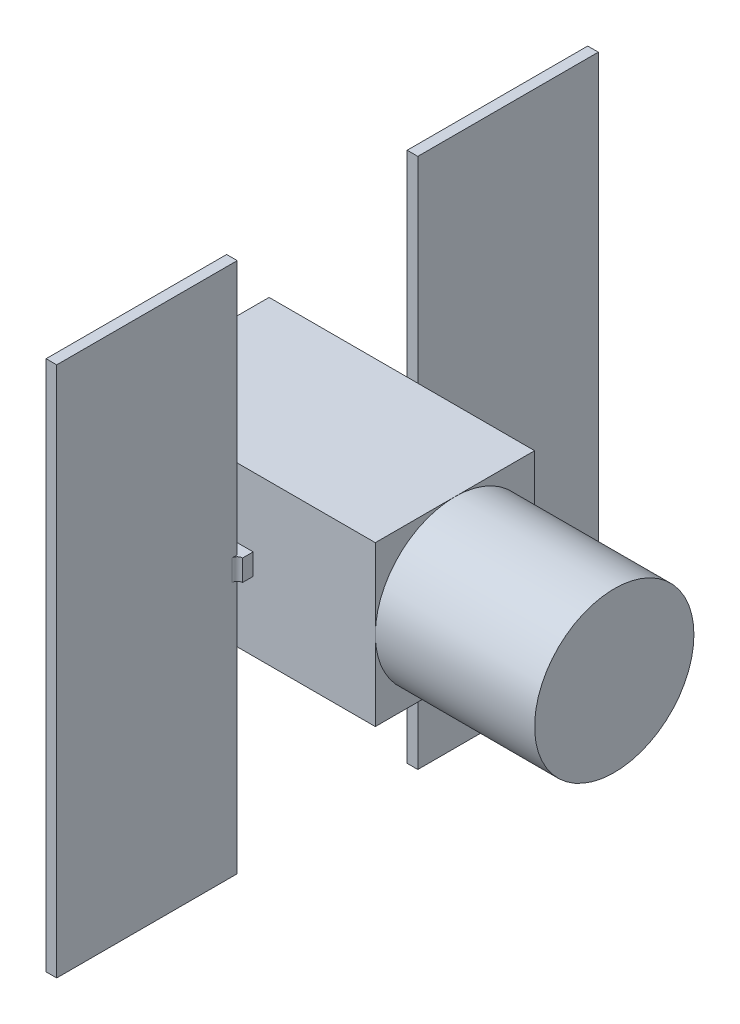
ISO-10303-21;
HEADER;
FILE_DESCRIPTION(('STEP AP214'),'2;1');
FILE_NAME('part.step','',(''),(''),'','','');
FILE_SCHEMA(('AUTOMOTIVE_DESIGN { 1 0 10303 214 1 1 1 1 }'));
ENDSEC;
DATA;
#1=APPLICATION_CONTEXT('core data for automotive mechanical design processes');
#2=APPLICATION_PROTOCOL_DEFINITION('international standard','automotive_design',2000,#1);
#3=PRODUCT_CONTEXT('',#1,'mechanical');
#4=PRODUCT('Part','Part','',(#3));
#5=PRODUCT_RELATED_PRODUCT_CATEGORY('part','',(#4));
#6=PRODUCT_DEFINITION_FORMATION('','',#4);
#7=PRODUCT_DEFINITION_CONTEXT('part definition',#1,'design');
#8=PRODUCT_DEFINITION('design','',#6,#7);
#9=PRODUCT_DEFINITION_SHAPE('','',#8);
#10=(LENGTH_UNIT() NAMED_UNIT(*) SI_UNIT(.MILLI.,.METRE.));
#11=(NAMED_UNIT(*) PLANE_ANGLE_UNIT() SI_UNIT($,.RADIAN.));
#12=(NAMED_UNIT(*) SI_UNIT($,.STERADIAN.) SOLID_ANGLE_UNIT());
#13=UNCERTAINTY_MEASURE_WITH_UNIT(LENGTH_MEASURE(1.E-05),#10,'distance_accuracy_value','');
#14=(GEOMETRIC_REPRESENTATION_CONTEXT(3) GLOBAL_UNCERTAINTY_ASSIGNED_CONTEXT((#13)) GLOBAL_UNIT_ASSIGNED_CONTEXT((#10,
#11,#12)) REPRESENTATION_CONTEXT('',''));
#15=CARTESIAN_POINT('',(0.,0.,0.));
#16=DIRECTION('',(0.,0.,1.));
#17=DIRECTION('',(1.,0.,0.));
#18=AXIS2_PLACEMENT_3D('',#15,#16,#17);
#19=CARTESIAN_POINT('',(250.,-150.,-150.));
#20=DIRECTION('',(1.,0.,0.));
#21=DIRECTION('',(0.,0.,-1.));
#22=AXIS2_PLACEMENT_3D('',#19,#20,#21);
#23=PLANE('',#22);
#24=CARTESIAN_POINT('',(250.,0.,0.));
#25=DIRECTION('',(1.,0.,0.));
#26=DIRECTION('',(0.,0.,-1.));
#27=AXIS2_PLACEMENT_3D('',#24,#25,#26);
#28=CIRCLE('',#27,150.);
#29=CARTESIAN_POINT('',(250.,0.,-150.));
#30=VERTEX_POINT('',#29);
#31=CARTESIAN_POINT('',(250.,150.,0.));
#32=VERTEX_POINT('',#31);
#33=EDGE_CURVE('E46',#30,#32,#28,.T.);
#34=ORIENTED_EDGE('',*,*,#33,.F.);
#35=DIRECTION('',(0.,1.,0.));
#36=VECTOR('',#35,1.);
#37=CARTESIAN_POINT('',(250.,-150.,-150.));
#38=LINE('',#37,#36);
#39=CARTESIAN_POINT('',(250.,150.,-150.));
#40=VERTEX_POINT('',#39);
#41=EDGE_CURVE('E242',#30,#40,#38,.T.);
#42=ORIENTED_EDGE('',*,*,#41,.T.);
#43=DIRECTION('',(0.,0.,1.));
#44=VECTOR('',#43,1.);
#45=CARTESIAN_POINT('',(250.,150.,-150.));
#46=LINE('',#45,#44);
#47=EDGE_CURVE('E254',#40,#32,#46,.T.);
#48=ORIENTED_EDGE('',*,*,#47,.T.);
#49=EDGE_LOOP('',(#34,#42,#48));
#50=FACE_BOUND('',#49,.T.);
#51=ADVANCED_FACE('F35',(#50),#23,.T.);
#52=CARTESIAN_POINT('',(250.,0.,150.));
#53=VERTEX_POINT('',#52);
#54=EDGE_CURVE('E11',#32,#53,#28,.T.);
#55=ORIENTED_EDGE('',*,*,#54,.F.);
#56=CARTESIAN_POINT('',(250.,150.,150.));
#57=VERTEX_POINT('',#56);
#58=EDGE_CURVE('E440',#32,#57,#46,.T.);
#59=ORIENTED_EDGE('',*,*,#58,.T.);
#60=DIRECTION('',(0.,1.,0.));
#61=VECTOR('',#60,1.);
#62=CARTESIAN_POINT('',(250.,-150.,150.));
#63=LINE('',#62,#61);
#64=EDGE_CURVE('E422',#53,#57,#63,.T.);
#65=ORIENTED_EDGE('',*,*,#64,.F.);
#66=EDGE_LOOP('',(#55,#59,#65));
#67=FACE_BOUND('',#66,.T.);
#68=ADVANCED_FACE('F553',(#67),#23,.T.);
#69=CARTESIAN_POINT('',(250.,-150.,0.));
#70=VERTEX_POINT('',#69);
#71=EDGE_CURVE('E44',#53,#70,#28,.T.);
#72=ORIENTED_EDGE('',*,*,#71,.F.);
#73=CARTESIAN_POINT('',(250.,-150.,150.));
#74=VERTEX_POINT('',#73);
#75=EDGE_CURVE('E423',#74,#53,#63,.T.);
#76=ORIENTED_EDGE('',*,*,#75,.F.);
#77=DIRECTION('',(0.,0.,1.));
#78=VECTOR('',#77,1.);
#79=CARTESIAN_POINT('',(250.,-150.,-150.));
#80=LINE('',#79,#78);
#81=EDGE_CURVE('E443',#70,#74,#80,.T.);
#82=ORIENTED_EDGE('',*,*,#81,.F.);
#83=EDGE_LOOP('',(#72,#76,#82));
#84=FACE_BOUND('',#83,.T.);
#85=ADVANCED_FACE('F558',(#84),#23,.T.);
#86=CARTESIAN_POINT('',(0.,0.,150.));
#87=DIRECTION('',(0.,0.,-1.));
#88=DIRECTION('',(-1.,0.,0.));
#89=AXIS2_PLACEMENT_3D('',#86,#87,#88);
#90=PLANE('',#89);
#91=ORIENTED_EDGE('',*,*,#75,.T.);
#92=ORIENTED_EDGE('',*,*,#64,.T.);
#93=DIRECTION('',(-1.,0.,0.));
#94=VECTOR('',#93,1.);
#95=CARTESIAN_POINT('',(-250.,150.,150.));
#96=LINE('',#95,#94);
#97=CARTESIAN_POINT('',(-250.,150.,150.));
#98=VERTEX_POINT('',#97);
#99=EDGE_CURVE('E426',#57,#98,#96,.T.);
#100=ORIENTED_EDGE('',*,*,#99,.T.);
#101=DIRECTION('',(0.,-1.,0.));
#102=VECTOR('',#101,1.);
#103=CARTESIAN_POINT('',(-250.,-150.,150.));
#104=LINE('',#103,#102);
#105=CARTESIAN_POINT('',(-250.,-150.,150.));
#106=VERTEX_POINT('',#105);
#107=EDGE_CURVE('E429',#98,#106,#104,.T.);
#108=ORIENTED_EDGE('',*,*,#107,.T.);
#109=DIRECTION('',(1.,0.,0.));
#110=VECTOR('',#109,1.);
#111=CARTESIAN_POINT('',(-250.,-150.,150.));
#112=LINE('',#111,#110);
#113=EDGE_CURVE('E252',#106,#74,#112,.T.);
#114=ORIENTED_EDGE('',*,*,#113,.T.);
#115=EDGE_LOOP('',(#91,#92,#100,#108,#114));
#116=FACE_BOUND('',#115,.T.);
#117=DIRECTION('',(0.,1.,0.));
#118=VECTOR('',#117,1.);
#119=CARTESIAN_POINT('',(20.,-20.,150.));
#120=LINE('',#119,#118);
#121=CARTESIAN_POINT('',(20.,-20.,150.));
#122=VERTEX_POINT('',#121);
#123=CARTESIAN_POINT('',(20.,20.,150.));
#124=VERTEX_POINT('',#123);
#125=EDGE_CURVE('E386',#122,#124,#120,.T.);
#126=ORIENTED_EDGE('',*,*,#125,.F.);
#127=DIRECTION('',(1.,0.,0.));
#128=VECTOR('',#127,1.);
#129=CARTESIAN_POINT('',(-20.,-20.,150.));
#130=LINE('',#129,#128);
#131=CARTESIAN_POINT('',(-20.,-20.,150.));
#132=VERTEX_POINT('',#131);
#133=EDGE_CURVE('E391',#132,#122,#130,.T.);
#134=ORIENTED_EDGE('',*,*,#133,.F.);
#135=DIRECTION('',(0.,-1.,0.));
#136=VECTOR('',#135,1.);
#137=CARTESIAN_POINT('',(-20.,-20.,150.));
#138=LINE('',#137,#136);
#139=CARTESIAN_POINT('',(-20.,20.,150.));
#140=VERTEX_POINT('',#139);
#141=EDGE_CURVE('E406',#140,#132,#138,.T.);
#142=ORIENTED_EDGE('',*,*,#141,.F.);
#143=DIRECTION('',(-1.,0.,0.));
#144=VECTOR('',#143,1.);
#145=CARTESIAN_POINT('',(-20.,20.,150.));
#146=LINE('',#145,#144);
#147=EDGE_CURVE('E403',#124,#140,#146,.T.);
#148=ORIENTED_EDGE('',*,*,#147,.F.);
#149=EDGE_LOOP('',(#126,#134,#142,#148));
#150=FACE_BOUND('',#149,.T.);
#151=ADVANCED_FACE('F564',(#116,#150),#90,.F.);
#152=EDGE_CURVE('E53',#70,#30,#28,.T.);
#153=ORIENTED_EDGE('',*,*,#152,.F.);
#154=CARTESIAN_POINT('',(250.,-150.,-150.));
#155=VERTEX_POINT('',#154);
#156=EDGE_CURVE('E237',#155,#70,#80,.T.);
#157=ORIENTED_EDGE('',*,*,#156,.F.);
#158=EDGE_CURVE('E233',#155,#30,#38,.T.);
#159=ORIENTED_EDGE('',*,*,#158,.T.);
#160=EDGE_LOOP('',(#153,#157,#159));
#161=FACE_BOUND('',#160,.T.);
#162=ADVANCED_FACE('F235',(#161),#23,.T.);
#163=CARTESIAN_POINT('',(-250.,-150.,-150.));
#164=DIRECTION('',(0.,-1.,0.));
#165=DIRECTION('',(0.,0.,-1.));
#166=AXIS2_PLACEMENT_3D('',#163,#164,#165);
#167=PLANE('',#166);
#168=ORIENTED_EDGE('',*,*,#156,.T.);
#169=ORIENTED_EDGE('',*,*,#81,.T.);
#170=ORIENTED_EDGE('',*,*,#113,.F.);
#171=DIRECTION('',(0.,0.,1.));
#172=VECTOR('',#171,1.);
#173=CARTESIAN_POINT('',(-250.,-150.,-150.));
#174=LINE('',#173,#172);
#175=CARTESIAN_POINT('',(-250.,-150.,-150.));
#176=VERTEX_POINT('',#175);
#177=EDGE_CURVE('E444',#176,#106,#174,.T.);
#178=ORIENTED_EDGE('',*,*,#177,.F.);
#179=DIRECTION('',(1.,0.,0.));
#180=VECTOR('',#179,1.);
#181=CARTESIAN_POINT('',(-250.,-150.,-150.));
#182=LINE('',#181,#180);
#183=EDGE_CURVE('E438',#176,#155,#182,.T.);
#184=ORIENTED_EDGE('',*,*,#183,.T.);
#185=EDGE_LOOP('',(#168,#169,#170,#178,#184));
#186=FACE_BOUND('',#185,.T.);
#187=ADVANCED_FACE('F563',(#186),#167,.T.);
#188=CARTESIAN_POINT('',(-250.,-150.,-150.));
#189=DIRECTION('',(-1.,0.,0.));
#190=DIRECTION('',(0.,0.,1.));
#191=AXIS2_PLACEMENT_3D('',#188,#189,#190);
#192=PLANE('',#191);
#193=CARTESIAN_POINT('',(-250.,0.,-58.043987529428));
#194=DIRECTION('',(-1.,0.,0.));
#195=DIRECTION('',(0.,0.,1.));
#196=AXIS2_PLACEMENT_3D('',#193,#194,#195);
#197=CIRCLE('',#196,40.);
#198=CARTESIAN_POINT('',(-250.,0.,-18.043987529428));
#199=VERTEX_POINT('',#198);
#200=EDGE_CURVE('E39',#199,#199,#197,.T.);
#201=ORIENTED_EDGE('',*,*,#200,.F.);
#202=EDGE_LOOP('',(#201));
#203=FACE_BOUND('',#202,.T.);
#204=CARTESIAN_POINT('',(-250.,0.,58.043987529428));
#205=DIRECTION('',(-1.,0.,0.));
#206=DIRECTION('',(0.,0.,1.));
#207=AXIS2_PLACEMENT_3D('',#204,#205,#206);
#208=CIRCLE('',#207,40.);
#209=CARTESIAN_POINT('',(-250.,0.,98.043987529428));
#210=VERTEX_POINT('',#209);
#211=EDGE_CURVE('E342',#210,#210,#208,.T.);
#212=ORIENTED_EDGE('',*,*,#211,.F.);
#213=EDGE_LOOP('',(#212));
#214=FACE_BOUND('',#213,.T.);
#215=ORIENTED_EDGE('',*,*,#177,.T.);
#216=ORIENTED_EDGE('',*,*,#107,.F.);
#217=DIRECTION('',(0.,0.,1.));
#218=VECTOR('',#217,1.);
#219=CARTESIAN_POINT('',(-250.,150.,-150.));
#220=LINE('',#219,#218);
#221=CARTESIAN_POINT('',(-250.,150.,-150.));
#222=VERTEX_POINT('',#221);
#223=EDGE_CURVE('E446',#222,#98,#220,.T.);
#224=ORIENTED_EDGE('',*,*,#223,.F.);
#225=DIRECTION('',(0.,-1.,0.));
#226=VECTOR('',#225,1.);
#227=CARTESIAN_POINT('',(-250.,-150.,-150.));
#228=LINE('',#227,#226);
#229=EDGE_CURVE('E435',#222,#176,#228,.T.);
#230=ORIENTED_EDGE('',*,*,#229,.T.);
#231=EDGE_LOOP('',(#215,#216,#224,#230));
#232=FACE_BOUND('',#231,.T.);
#233=ADVANCED_FACE('F569',(#203,#214,#232),#192,.T.);
#234=CARTESIAN_POINT('',(-250.,150.,-150.));
#235=DIRECTION('',(0.,1.,0.));
#236=DIRECTION('',(0.,0.,1.));
#237=AXIS2_PLACEMENT_3D('',#234,#235,#236);
#238=PLANE('',#237);
#239=ORIENTED_EDGE('',*,*,#223,.T.);
#240=ORIENTED_EDGE('',*,*,#99,.F.);
#241=ORIENTED_EDGE('',*,*,#58,.F.);
#242=ORIENTED_EDGE('',*,*,#47,.F.);
#243=DIRECTION('',(-1.,0.,0.));
#244=VECTOR('',#243,1.);
#245=CARTESIAN_POINT('',(-250.,150.,-150.));
#246=LINE('',#245,#244);
#247=EDGE_CURVE('E241',#40,#222,#246,.T.);
#248=ORIENTED_EDGE('',*,*,#247,.T.);
#249=EDGE_LOOP('',(#239,#240,#241,#242,#248));
#250=FACE_BOUND('',#249,.T.);
#251=ADVANCED_FACE('F602',(#250),#238,.T.);
#252=CARTESIAN_POINT('',(0.,0.,-150.));
#253=DIRECTION('',(0.,0.,-1.));
#254=DIRECTION('',(-1.,0.,0.));
#255=AXIS2_PLACEMENT_3D('',#252,#253,#254);
#256=PLANE('',#255);
#257=DIRECTION('',(0.,1.,0.));
#258=VECTOR('',#257,1.);
#259=CARTESIAN_POINT('',(20.,-20.,-150.));
#260=LINE('',#259,#258);
#261=CARTESIAN_POINT('',(20.,-20.,-150.));
#262=VERTEX_POINT('',#261);
#263=CARTESIAN_POINT('',(20.,20.,-150.));
#264=VERTEX_POINT('',#263);
#265=EDGE_CURVE('E307',#262,#264,#260,.T.);
#266=ORIENTED_EDGE('',*,*,#265,.T.);
#267=DIRECTION('',(-1.,0.,0.));
#268=VECTOR('',#267,1.);
#269=CARTESIAN_POINT('',(-20.,20.,-150.));
#270=LINE('',#269,#268);
#271=CARTESIAN_POINT('',(-20.,20.,-150.));
#272=VERTEX_POINT('',#271);
#273=EDGE_CURVE('E312',#264,#272,#270,.T.);
#274=ORIENTED_EDGE('',*,*,#273,.T.);
#275=DIRECTION('',(0.,-1.,0.));
#276=VECTOR('',#275,1.);
#277=CARTESIAN_POINT('',(-20.,-20.,-150.));
#278=LINE('',#277,#276);
#279=CARTESIAN_POINT('',(-20.,-20.,-150.));
#280=VERTEX_POINT('',#279);
#281=EDGE_CURVE('E325',#272,#280,#278,.T.);
#282=ORIENTED_EDGE('',*,*,#281,.T.);
#283=DIRECTION('',(1.,0.,0.));
#284=VECTOR('',#283,1.);
#285=CARTESIAN_POINT('',(-20.,-20.,-150.));
#286=LINE('',#285,#284);
#287=EDGE_CURVE('E323',#280,#262,#286,.T.);
#288=ORIENTED_EDGE('',*,*,#287,.T.);
#289=EDGE_LOOP('',(#266,#274,#282,#288));
#290=FACE_BOUND('',#289,.T.);
#291=ORIENTED_EDGE('',*,*,#158,.F.);
#292=ORIENTED_EDGE('',*,*,#183,.F.);
#293=ORIENTED_EDGE('',*,*,#229,.F.);
#294=ORIENTED_EDGE('',*,*,#247,.F.);
#295=ORIENTED_EDGE('',*,*,#41,.F.);
#296=EDGE_LOOP('',(#291,#292,#293,#294,#295));
#297=FACE_BOUND('',#296,.T.);
#298=ADVANCED_FACE('F246',(#290,#297),#256,.T.);
#299=CARTESIAN_POINT('',(20.,-20.,170.));
#300=DIRECTION('',(-1.,0.,0.));
#301=DIRECTION('',(0.,0.,1.));
#302=AXIS2_PLACEMENT_3D('',#299,#300,#301);
#303=PLANE('',#302);
#304=ORIENTED_EDGE('',*,*,#125,.T.);
#305=DIRECTION('',(0.,0.,-1.));
#306=VECTOR('',#305,1.);
#307=CARTESIAN_POINT('',(20.,20.,170.));
#308=LINE('',#307,#306);
#309=CARTESIAN_POINT('',(20.,20.,170.));
#310=VERTEX_POINT('',#309);
#311=EDGE_CURVE('E419',#310,#124,#308,.T.);
#312=ORIENTED_EDGE('',*,*,#311,.F.);
#313=DIRECTION('',(0.,1.,0.));
#314=VECTOR('',#313,1.);
#315=CARTESIAN_POINT('',(20.,-20.,170.));
#316=LINE('',#315,#314);
#317=CARTESIAN_POINT('',(20.,-20.,170.));
#318=VERTEX_POINT('',#317);
#319=EDGE_CURVE('E387',#318,#310,#316,.T.);
#320=ORIENTED_EDGE('',*,*,#319,.F.);
#321=DIRECTION('',(0.,0.,-1.));
#322=VECTOR('',#321,1.);
#323=CARTESIAN_POINT('',(20.,-20.,170.));
#324=LINE('',#323,#322);
#325=EDGE_CURVE('E400',#318,#122,#324,.T.);
#326=ORIENTED_EDGE('',*,*,#325,.T.);
#327=EDGE_LOOP('',(#304,#312,#320,#326));
#328=FACE_BOUND('',#327,.T.);
#329=ADVANCED_FACE('F614',(#328),#303,.F.);
#330=CARTESIAN_POINT('',(-20.,20.,170.));
#331=DIRECTION('',(0.,-1.,0.));
#332=DIRECTION('',(0.,0.,-1.));
#333=AXIS2_PLACEMENT_3D('',#330,#331,#332);
#334=PLANE('',#333);
#335=ORIENTED_EDGE('',*,*,#147,.T.);
#336=DIRECTION('',(0.,0.,-1.));
#337=VECTOR('',#336,1.);
#338=CARTESIAN_POINT('',(-20.,20.,170.));
#339=LINE('',#338,#337);
#340=CARTESIAN_POINT('',(-20.,20.,170.));
#341=VERTEX_POINT('',#340);
#342=EDGE_CURVE('E416',#341,#140,#339,.T.);
#343=ORIENTED_EDGE('',*,*,#342,.F.);
#344=CARTESIAN_POINT('',(-20.,20.,180.));
#345=DIRECTION('',(0.,-1.,0.));
#346=DIRECTION('',(0.,0.,-1.));
#347=AXIS2_PLACEMENT_3D('',#344,#345,#346);
#348=CIRCLE('',#347,10.);
#349=CARTESIAN_POINT('',(-10.,20.,180.));
#350=VERTEX_POINT('',#349);
#351=EDGE_CURVE('E347',#341,#350,#348,.T.);
#352=ORIENTED_EDGE('',*,*,#351,.T.);
#353=DIRECTION('',(0.,0.,1.));
#354=VECTOR('',#353,1.);
#355=CARTESIAN_POINT('',(-10.,20.,170.));
#356=LINE('',#355,#354);
#357=CARTESIAN_POINT('',(-10.,20.,170.));
#358=VERTEX_POINT('',#357);
#359=EDGE_CURVE('E456',#358,#350,#356,.T.);
#360=ORIENTED_EDGE('',*,*,#359,.F.);
#361=DIRECTION('',(-1.,0.,0.));
#362=VECTOR('',#361,1.);
#363=CARTESIAN_POINT('',(-20.,20.,170.));
#364=LINE('',#363,#362);
#365=CARTESIAN_POINT('',(10.,20.,170.));
#366=VERTEX_POINT('',#365);
#367=EDGE_CURVE('E390',#366,#358,#364,.T.);
#368=ORIENTED_EDGE('',*,*,#367,.F.);
#369=DIRECTION('',(0.,0.,-1.));
#370=VECTOR('',#369,1.);
#371=CARTESIAN_POINT('',(10.,20.,170.));
#372=LINE('',#371,#370);
#373=CARTESIAN_POINT('',(10.,20.,180.));
#374=VERTEX_POINT('',#373);
#375=EDGE_CURVE('E454',#374,#366,#372,.T.);
#376=ORIENTED_EDGE('',*,*,#375,.F.);
#377=CARTESIAN_POINT('',(20.,20.,180.));
#378=DIRECTION('',(0.,-1.,0.));
#379=DIRECTION('',(0.,0.,-1.));
#380=AXIS2_PLACEMENT_3D('',#377,#378,#379);
#381=CIRCLE('',#380,10.);
#382=EDGE_CURVE('E464',#374,#310,#381,.T.);
#383=ORIENTED_EDGE('',*,*,#382,.T.);
#384=ORIENTED_EDGE('',*,*,#311,.T.);
#385=EDGE_LOOP('',(#335,#343,#352,#360,#368,#376,#383,#384));
#386=FACE_BOUND('',#385,.T.);
#387=ADVANCED_FACE('F826',(#386),#334,.F.);
#388=CARTESIAN_POINT('',(-20.,-20.,170.));
#389=DIRECTION('',(1.,0.,0.));
#390=DIRECTION('',(0.,0.,-1.));
#391=AXIS2_PLACEMENT_3D('',#388,#389,#390);
#392=PLANE('',#391);
#393=ORIENTED_EDGE('',*,*,#141,.T.);
#394=DIRECTION('',(0.,0.,-1.));
#395=VECTOR('',#394,1.);
#396=CARTESIAN_POINT('',(-20.,-20.,170.));
#397=LINE('',#396,#395);
#398=CARTESIAN_POINT('',(-20.,-20.,170.));
#399=VERTEX_POINT('',#398);
#400=EDGE_CURVE('E413',#399,#132,#397,.T.);
#401=ORIENTED_EDGE('',*,*,#400,.F.);
#402=DIRECTION('',(0.,-1.,0.));
#403=VECTOR('',#402,1.);
#404=CARTESIAN_POINT('',(-20.,-20.,170.));
#405=LINE('',#404,#403);
#406=EDGE_CURVE('E394',#341,#399,#405,.T.);
#407=ORIENTED_EDGE('',*,*,#406,.F.);
#408=ORIENTED_EDGE('',*,*,#342,.T.);
#409=EDGE_LOOP('',(#393,#401,#407,#408));
#410=FACE_BOUND('',#409,.T.);
#411=ADVANCED_FACE('F836',(#410),#392,.F.);
#412=CARTESIAN_POINT('',(-20.,-20.,170.));
#413=DIRECTION('',(0.,1.,0.));
#414=DIRECTION('',(0.,0.,1.));
#415=AXIS2_PLACEMENT_3D('',#412,#413,#414);
#416=PLANE('',#415);
#417=ORIENTED_EDGE('',*,*,#133,.T.);
#418=ORIENTED_EDGE('',*,*,#325,.F.);
#419=CARTESIAN_POINT('',(20.,-20.,180.));
#420=DIRECTION('',(0.,1.,0.));
#421=DIRECTION('',(0.,0.,1.));
#422=AXIS2_PLACEMENT_3D('',#419,#420,#421);
#423=CIRCLE('',#422,10.);
#424=CARTESIAN_POINT('',(10.,-20.,180.));
#425=VERTEX_POINT('',#424);
#426=EDGE_CURVE('E466',#318,#425,#423,.T.);
#427=ORIENTED_EDGE('',*,*,#426,.T.);
#428=DIRECTION('',(0.,0.,1.));
#429=VECTOR('',#428,1.);
#430=CARTESIAN_POINT('',(10.,-20.,170.));
#431=LINE('',#430,#429);
#432=CARTESIAN_POINT('',(10.,-20.,170.));
#433=VERTEX_POINT('',#432);
#434=EDGE_CURVE('E442',#433,#425,#431,.T.);
#435=ORIENTED_EDGE('',*,*,#434,.F.);
#436=DIRECTION('',(1.,0.,0.));
#437=VECTOR('',#436,1.);
#438=CARTESIAN_POINT('',(-20.,-20.,170.));
#439=LINE('',#438,#437);
#440=CARTESIAN_POINT('',(-10.,-20.,170.));
#441=VERTEX_POINT('',#440);
#442=EDGE_CURVE('E397',#441,#433,#439,.T.);
#443=ORIENTED_EDGE('',*,*,#442,.F.);
#444=DIRECTION('',(0.,0.,-1.));
#445=VECTOR('',#444,1.);
#446=CARTESIAN_POINT('',(-10.,-20.,170.));
#447=LINE('',#446,#445);
#448=CARTESIAN_POINT('',(-10.,-20.,180.));
#449=VERTEX_POINT('',#448);
#450=EDGE_CURVE('E462',#449,#441,#447,.T.);
#451=ORIENTED_EDGE('',*,*,#450,.F.);
#452=CARTESIAN_POINT('',(-20.,-20.,180.));
#453=DIRECTION('',(0.,1.,0.));
#454=DIRECTION('',(0.,0.,1.));
#455=AXIS2_PLACEMENT_3D('',#452,#453,#454);
#456=CIRCLE('',#455,10.);
#457=EDGE_CURVE('E468',#449,#399,#456,.T.);
#458=ORIENTED_EDGE('',*,*,#457,.T.);
#459=ORIENTED_EDGE('',*,*,#400,.T.);
#460=EDGE_LOOP('',(#417,#418,#427,#435,#443,#451,#458,#459));
#461=FACE_BOUND('',#460,.T.);
#462=ADVANCED_FACE('F845',(#461),#416,.F.);
#463=CARTESIAN_POINT('',(0.,0.,170.));
#464=DIRECTION('',(0.,0.,-1.));
#465=DIRECTION('',(-1.,0.,0.));
#466=AXIS2_PLACEMENT_3D('',#463,#464,#465);
#467=PLANE('',#466);
#468=DIRECTION('',(0.,1.,0.));
#469=VECTOR('',#468,1.);
#470=CARTESIAN_POINT('',(10.,-500.,170.));
#471=LINE('',#470,#469);
#472=CARTESIAN_POINT('',(10.,500.,170.));
#473=VERTEX_POINT('',#472);
#474=EDGE_CURVE('E351',#366,#473,#471,.T.);
#475=ORIENTED_EDGE('',*,*,#474,.F.);
#476=ORIENTED_EDGE('',*,*,#367,.T.);
#477=DIRECTION('',(0.,-1.,0.));
#478=VECTOR('',#477,1.);
#479=CARTESIAN_POINT('',(-10.,-500.,170.));
#480=LINE('',#479,#478);
#481=CARTESIAN_POINT('',(-10.,500.,170.));
#482=VERTEX_POINT('',#481);
#483=EDGE_CURVE('E371',#482,#358,#480,.T.);
#484=ORIENTED_EDGE('',*,*,#483,.F.);
#485=DIRECTION('',(-1.,0.,0.));
#486=VECTOR('',#485,1.);
#487=CARTESIAN_POINT('',(-10.,500.,170.));
#488=LINE('',#487,#486);
#489=EDGE_CURVE('E368',#473,#482,#488,.T.);
#490=ORIENTED_EDGE('',*,*,#489,.F.);
#491=EDGE_LOOP('',(#475,#476,#484,#490));
#492=FACE_BOUND('',#491,.T.);
#493=ADVANCED_FACE('F771',(#492),#467,.T.);
#494=CARTESIAN_POINT('',(10.,-500.,510.));
#495=DIRECTION('',(-1.,0.,0.));
#496=DIRECTION('',(0.,0.,1.));
#497=AXIS2_PLACEMENT_3D('',#494,#495,#496);
#498=PLANE('',#497);
#499=DIRECTION('',(0.,1.,0.));
#500=VECTOR('',#499,1.);
#501=CARTESIAN_POINT('',(10.,20.,180.));
#502=LINE('',#501,#500);
#503=EDGE_CURVE('E451',#425,#374,#502,.T.);
#504=ORIENTED_EDGE('',*,*,#503,.T.);
#505=ORIENTED_EDGE('',*,*,#375,.T.);
#506=ORIENTED_EDGE('',*,*,#474,.T.);
#507=DIRECTION('',(0.,0.,-1.));
#508=VECTOR('',#507,1.);
#509=CARTESIAN_POINT('',(10.,500.,510.));
#510=LINE('',#509,#508);
#511=CARTESIAN_POINT('',(10.,500.,510.));
#512=VERTEX_POINT('',#511);
#513=EDGE_CURVE('E383',#512,#473,#510,.T.);
#514=ORIENTED_EDGE('',*,*,#513,.F.);
#515=DIRECTION('',(0.,1.,0.));
#516=VECTOR('',#515,1.);
#517=CARTESIAN_POINT('',(10.,-500.,510.));
#518=LINE('',#517,#516);
#519=CARTESIAN_POINT('',(10.,-500.,510.));
#520=VERTEX_POINT('',#519);
#521=EDGE_CURVE('E354',#520,#512,#518,.T.);
#522=ORIENTED_EDGE('',*,*,#521,.F.);
#523=DIRECTION('',(0.,0.,-1.));
#524=VECTOR('',#523,1.);
#525=CARTESIAN_POINT('',(10.,-500.,510.));
#526=LINE('',#525,#524);
#527=CARTESIAN_POINT('',(10.,-500.,170.));
#528=VERTEX_POINT('',#527);
#529=EDGE_CURVE('E364',#520,#528,#526,.T.);
#530=ORIENTED_EDGE('',*,*,#529,.T.);
#531=EDGE_CURVE('E365',#528,#433,#471,.T.);
#532=ORIENTED_EDGE('',*,*,#531,.T.);
#533=ORIENTED_EDGE('',*,*,#434,.T.);
#534=EDGE_LOOP('',(#504,#505,#506,#514,#522,#530,#532,#533));
#535=FACE_BOUND('',#534,.T.);
#536=ADVANCED_FACE('F768',(#535),#498,.F.);
#537=CARTESIAN_POINT('',(-10.,500.,510.));
#538=DIRECTION('',(0.,-1.,0.));
#539=DIRECTION('',(0.,0.,-1.));
#540=AXIS2_PLACEMENT_3D('',#537,#538,#539);
#541=PLANE('',#540);
#542=ORIENTED_EDGE('',*,*,#489,.T.);
#543=DIRECTION('',(0.,0.,-1.));
#544=VECTOR('',#543,1.);
#545=CARTESIAN_POINT('',(-10.,500.,510.));
#546=LINE('',#545,#544);
#547=CARTESIAN_POINT('',(-10.,500.,510.));
#548=VERTEX_POINT('',#547);
#549=EDGE_CURVE('E380',#548,#482,#546,.T.);
#550=ORIENTED_EDGE('',*,*,#549,.F.);
#551=DIRECTION('',(-1.,0.,0.));
#552=VECTOR('',#551,1.);
#553=CARTESIAN_POINT('',(-10.,500.,510.));
#554=LINE('',#553,#552);
#555=EDGE_CURVE('E357',#512,#548,#554,.T.);
#556=ORIENTED_EDGE('',*,*,#555,.F.);
#557=ORIENTED_EDGE('',*,*,#513,.T.);
#558=EDGE_LOOP('',(#542,#550,#556,#557));
#559=FACE_BOUND('',#558,.T.);
#560=ADVANCED_FACE('F758',(#559),#541,.F.);
#561=CARTESIAN_POINT('',(-10.,-500.,510.));
#562=DIRECTION('',(1.,0.,0.));
#563=DIRECTION('',(0.,0.,-1.));
#564=AXIS2_PLACEMENT_3D('',#561,#562,#563);
#565=PLANE('',#564);
#566=DIRECTION('',(0.,-1.,0.));
#567=VECTOR('',#566,1.);
#568=CARTESIAN_POINT('',(-10.,-20.,180.));
#569=LINE('',#568,#567);
#570=EDGE_CURVE('E459',#350,#449,#569,.T.);
#571=ORIENTED_EDGE('',*,*,#570,.T.);
#572=ORIENTED_EDGE('',*,*,#450,.T.);
#573=CARTESIAN_POINT('',(-10.,-500.,170.));
#574=VERTEX_POINT('',#573);
#575=EDGE_CURVE('E370',#441,#574,#480,.T.);
#576=ORIENTED_EDGE('',*,*,#575,.T.);
#577=DIRECTION('',(0.,0.,-1.));
#578=VECTOR('',#577,1.);
#579=CARTESIAN_POINT('',(-10.,-500.,510.));
#580=LINE('',#579,#578);
#581=CARTESIAN_POINT('',(-10.,-500.,510.));
#582=VERTEX_POINT('',#581);
#583=EDGE_CURVE('E377',#582,#574,#580,.T.);
#584=ORIENTED_EDGE('',*,*,#583,.F.);
#585=DIRECTION('',(0.,-1.,0.));
#586=VECTOR('',#585,1.);
#587=CARTESIAN_POINT('',(-10.,-500.,510.));
#588=LINE('',#587,#586);
#589=EDGE_CURVE('E360',#548,#582,#588,.T.);
#590=ORIENTED_EDGE('',*,*,#589,.F.);
#591=ORIENTED_EDGE('',*,*,#549,.T.);
#592=ORIENTED_EDGE('',*,*,#483,.T.);
#593=ORIENTED_EDGE('',*,*,#359,.T.);
#594=EDGE_LOOP('',(#571,#572,#576,#584,#590,#591,#592,#593));
#595=FACE_BOUND('',#594,.T.);
#596=ADVANCED_FACE('F752',(#595),#565,.F.);
#597=CARTESIAN_POINT('',(-10.,-500.,510.));
#598=DIRECTION('',(0.,1.,0.));
#599=DIRECTION('',(0.,0.,1.));
#600=AXIS2_PLACEMENT_3D('',#597,#598,#599);
#601=PLANE('',#600);
#602=DIRECTION('',(1.,0.,0.));
#603=VECTOR('',#602,1.);
#604=CARTESIAN_POINT('',(-10.,-500.,170.));
#605=LINE('',#604,#603);
#606=EDGE_CURVE('E358',#574,#528,#605,.T.);
#607=ORIENTED_EDGE('',*,*,#606,.T.);
#608=ORIENTED_EDGE('',*,*,#529,.F.);
#609=DIRECTION('',(1.,0.,0.));
#610=VECTOR('',#609,1.);
#611=CARTESIAN_POINT('',(-10.,-500.,510.));
#612=LINE('',#611,#610);
#613=EDGE_CURVE('E362',#582,#520,#612,.T.);
#614=ORIENTED_EDGE('',*,*,#613,.F.);
#615=ORIENTED_EDGE('',*,*,#583,.T.);
#616=EDGE_LOOP('',(#607,#608,#614,#615));
#617=FACE_BOUND('',#616,.T.);
#618=ADVANCED_FACE('F757',(#617),#601,.F.);
#619=CARTESIAN_POINT('',(0.,0.,510.));
#620=DIRECTION('',(0.,0.,-1.));
#621=DIRECTION('',(-1.,0.,0.));
#622=AXIS2_PLACEMENT_3D('',#619,#620,#621);
#623=PLANE('',#622);
#624=ORIENTED_EDGE('',*,*,#521,.T.);
#625=ORIENTED_EDGE('',*,*,#555,.T.);
#626=ORIENTED_EDGE('',*,*,#589,.T.);
#627=ORIENTED_EDGE('',*,*,#613,.T.);
#628=EDGE_LOOP('',(#624,#625,#626,#627));
#629=FACE_BOUND('',#628,.T.);
#630=ADVANCED_FACE('F796',(#629),#623,.F.);
#631=ORIENTED_EDGE('',*,*,#575,.F.);
#632=ORIENTED_EDGE('',*,*,#442,.T.);
#633=ORIENTED_EDGE('',*,*,#531,.F.);
#634=ORIENTED_EDGE('',*,*,#606,.F.);
#635=EDGE_LOOP('',(#631,#632,#633,#634));
#636=FACE_BOUND('',#635,.T.);
#637=ADVANCED_FACE('F806',(#636),#467,.T.);
#638=CARTESIAN_POINT('',(20.,-500.,180.));
#639=DIRECTION('',(0.,-1.,0.));
#640=DIRECTION('',(0.,0.,-1.));
#641=AXIS2_PLACEMENT_3D('',#638,#639,#640);
#642=CYLINDRICAL_SURFACE('',#641,10.);
#643=ORIENTED_EDGE('',*,*,#426,.F.);
#644=ORIENTED_EDGE('',*,*,#319,.T.);
#645=ORIENTED_EDGE('',*,*,#382,.F.);
#646=ORIENTED_EDGE('',*,*,#503,.F.);
#647=EDGE_LOOP('',(#643,#644,#645,#646));
#648=FACE_BOUND('',#647,.T.);
#649=ADVANCED_FACE('F816',(#648),#642,.F.);
#650=CARTESIAN_POINT('',(-20.,-500.,180.));
#651=DIRECTION('',(0.,1.,0.));
#652=DIRECTION('',(0.,0.,1.));
#653=AXIS2_PLACEMENT_3D('',#650,#651,#652);
#654=CYLINDRICAL_SURFACE('',#653,10.);
#655=ORIENTED_EDGE('',*,*,#351,.F.);
#656=ORIENTED_EDGE('',*,*,#406,.T.);
#657=ORIENTED_EDGE('',*,*,#457,.F.);
#658=ORIENTED_EDGE('',*,*,#570,.F.);
#659=EDGE_LOOP('',(#655,#656,#657,#658));
#660=FACE_BOUND('',#659,.T.);
#661=ADVANCED_FACE('F894',(#660),#654,.F.);
#662=CARTESIAN_POINT('',(-400.,0.,58.043987529428));
#663=DIRECTION('',(1.,0.,0.));
#664=DIRECTION('',(0.,0.,-1.));
#665=AXIS2_PLACEMENT_3D('',#662,#663,#664);
#666=CYLINDRICAL_SURFACE('',#665,40.);
#667=CARTESIAN_POINT('',(-400.,0.,58.043987529428));
#668=DIRECTION('',(-1.,0.,0.));
#669=DIRECTION('',(0.,0.,1.));
#670=AXIS2_PLACEMENT_3D('',#667,#668,#669);
#671=CIRCLE('',#670,40.);
#672=CARTESIAN_POINT('',(-400.,0.,98.043987529428));
#673=VERTEX_POINT('',#672);
#674=EDGE_CURVE('E348',#673,#673,#671,.T.);
#675=ORIENTED_EDGE('',*,*,#674,.F.);
#676=EDGE_LOOP('',(#675));
#677=FACE_BOUND('',#676,.T.);
#678=ORIENTED_EDGE('',*,*,#211,.T.);
#679=EDGE_LOOP('',(#678));
#680=FACE_BOUND('',#679,.T.);
#681=ADVANCED_FACE('F906',(#677,#680),#666,.T.);
#682=CARTESIAN_POINT('',(-400.,0.,58.043987529428));
#683=DIRECTION('',(-1.,0.,0.));
#684=DIRECTION('',(0.,0.,1.));
#685=AXIS2_PLACEMENT_3D('',#682,#683,#684);
#686=PLANE('',#685);
#687=CARTESIAN_POINT('',(-400.,0.,58.043987529428));
#688=DIRECTION('',(-1.,0.,0.));
#689=DIRECTION('',(0.,0.,1.));
#690=AXIS2_PLACEMENT_3D('',#687,#688,#689);
#691=CIRCLE('',#690,9.99999999999999);
#692=CARTESIAN_POINT('',(-400.,0.,68.043987529428));
#693=VERTEX_POINT('',#692);
#694=EDGE_CURVE('E343',#693,#693,#691,.T.);
#695=ORIENTED_EDGE('',*,*,#694,.F.);
#696=EDGE_LOOP('',(#695));
#697=FACE_BOUND('',#696,.T.);
#698=ORIENTED_EDGE('',*,*,#674,.T.);
#699=EDGE_LOOP('',(#698));
#700=FACE_BOUND('',#699,.T.);
#701=ADVANCED_FACE('F911',(#697,#700),#686,.T.);
#702=CARTESIAN_POINT('',(-450.,0.,58.043987529428));
#703=DIRECTION('',(1.,0.,0.));
#704=DIRECTION('',(0.,0.,-1.));
#705=AXIS2_PLACEMENT_3D('',#702,#703,#704);
#706=CYLINDRICAL_SURFACE('',#705,9.99999999999999);
#707=CARTESIAN_POINT('',(-450.,0.,58.043987529428));
#708=DIRECTION('',(-1.,0.,0.));
#709=DIRECTION('',(0.,0.,1.));
#710=AXIS2_PLACEMENT_3D('',#707,#708,#709);
#711=CIRCLE('',#710,9.99999999999999);
#712=CARTESIAN_POINT('',(-450.,0.,68.043987529428));
#713=VERTEX_POINT('',#712);
#714=EDGE_CURVE('E339',#713,#713,#711,.T.);
#715=ORIENTED_EDGE('',*,*,#714,.F.);
#716=EDGE_LOOP('',(#715));
#717=FACE_BOUND('',#716,.T.);
#718=ORIENTED_EDGE('',*,*,#694,.T.);
#719=EDGE_LOOP('',(#718));
#720=FACE_BOUND('',#719,.T.);
#721=ADVANCED_FACE('F932',(#717,#720),#706,.T.);
#722=CARTESIAN_POINT('',(-450.,0.,58.043987529428));
#723=DIRECTION('',(-1.,0.,0.));
#724=DIRECTION('',(0.,0.,1.));
#725=AXIS2_PLACEMENT_3D('',#722,#723,#724);
#726=PLANE('',#725);
#727=ORIENTED_EDGE('',*,*,#714,.T.);
#728=EDGE_LOOP('',(#727));
#729=FACE_BOUND('',#728,.T.);
#730=ADVANCED_FACE('F706',(#729),#726,.T.);
#731=CARTESIAN_POINT('',(20.,-20.,-170.));
#732=DIRECTION('',(1.,0.,0.));
#733=DIRECTION('',(0.,0.,-1.));
#734=AXIS2_PLACEMENT_3D('',#731,#732,#733);
#735=PLANE('',#734);
#736=ORIENTED_EDGE('',*,*,#265,.F.);
#737=DIRECTION('',(0.,0.,1.));
#738=VECTOR('',#737,1.);
#739=CARTESIAN_POINT('',(20.,-20.,-170.));
#740=LINE('',#739,#738);
#741=CARTESIAN_POINT('',(20.,-20.,-170.));
#742=VERTEX_POINT('',#741);
#743=EDGE_CURVE('E336',#742,#262,#740,.T.);
#744=ORIENTED_EDGE('',*,*,#743,.F.);
#745=DIRECTION('',(0.,1.,0.));
#746=VECTOR('',#745,1.);
#747=CARTESIAN_POINT('',(20.,-20.,-170.));
#748=LINE('',#747,#746);
#749=CARTESIAN_POINT('',(20.,20.,-170.));
#750=VERTEX_POINT('',#749);
#751=EDGE_CURVE('E308',#742,#750,#748,.T.);
#752=ORIENTED_EDGE('',*,*,#751,.T.);
#753=DIRECTION('',(0.,0.,1.));
#754=VECTOR('',#753,1.);
#755=CARTESIAN_POINT('',(20.,20.,-170.));
#756=LINE('',#755,#754);
#757=EDGE_CURVE('E321',#750,#264,#756,.T.);
#758=ORIENTED_EDGE('',*,*,#757,.T.);
#759=EDGE_LOOP('',(#736,#744,#752,#758));
#760=FACE_BOUND('',#759,.T.);
#761=ADVANCED_FACE('F512',(#760),#735,.T.);
#762=CARTESIAN_POINT('',(-20.,-20.,-170.));
#763=DIRECTION('',(0.,-1.,0.));
#764=DIRECTION('',(0.,0.,-1.));
#765=AXIS2_PLACEMENT_3D('',#762,#763,#764);
#766=PLANE('',#765);
#767=ORIENTED_EDGE('',*,*,#287,.F.);
#768=DIRECTION('',(0.,0.,1.));
#769=VECTOR('',#768,1.);
#770=CARTESIAN_POINT('',(-20.,-20.,-170.));
#771=LINE('',#770,#769);
#772=CARTESIAN_POINT('',(-20.,-20.,-170.));
#773=VERTEX_POINT('',#772);
#774=EDGE_CURVE('E333',#773,#280,#771,.T.);
#775=ORIENTED_EDGE('',*,*,#774,.F.);
#776=CARTESIAN_POINT('',(-20.,-20.,-180.));
#777=DIRECTION('',(0.,-1.,0.));
#778=DIRECTION('',(0.,0.,-1.));
#779=AXIS2_PLACEMENT_3D('',#776,#777,#778);
#780=CIRCLE('',#779,10.);
#781=CARTESIAN_POINT('',(-10.,-20.,-180.));
#782=VERTEX_POINT('',#781);
#783=EDGE_CURVE('E490',#773,#782,#780,.F.);
#784=ORIENTED_EDGE('',*,*,#783,.T.);
#785=DIRECTION('',(0.,0.,-1.));
#786=VECTOR('',#785,1.);
#787=CARTESIAN_POINT('',(-10.,-20.,-170.));
#788=LINE('',#787,#786);
#789=CARTESIAN_POINT('',(-10.,-20.,-170.));
#790=VERTEX_POINT('',#789);
#791=EDGE_CURVE('E483',#790,#782,#788,.T.);
#792=ORIENTED_EDGE('',*,*,#791,.F.);
#793=DIRECTION('',(1.,0.,0.));
#794=VECTOR('',#793,1.);
#795=CARTESIAN_POINT('',(-20.,-20.,-170.));
#796=LINE('',#795,#794);
#797=CARTESIAN_POINT('',(10.,-20.,-170.));
#798=VERTEX_POINT('',#797);
#799=EDGE_CURVE('E311',#790,#798,#796,.T.);
#800=ORIENTED_EDGE('',*,*,#799,.T.);
#801=DIRECTION('',(0.,0.,1.));
#802=VECTOR('',#801,1.);
#803=CARTESIAN_POINT('',(10.,-20.,-170.));
#804=LINE('',#803,#802);
#805=CARTESIAN_POINT('',(10.,-20.,-180.));
#806=VERTEX_POINT('',#805);
#807=EDGE_CURVE('E346',#806,#798,#804,.T.);
#808=ORIENTED_EDGE('',*,*,#807,.F.);
#809=CARTESIAN_POINT('',(20.,-20.,-180.));
#810=DIRECTION('',(0.,-1.,0.));
#811=DIRECTION('',(0.,0.,-1.));
#812=AXIS2_PLACEMENT_3D('',#809,#810,#811);
#813=CIRCLE('',#812,10.);
#814=EDGE_CURVE('E488',#806,#742,#813,.F.);
#815=ORIENTED_EDGE('',*,*,#814,.T.);
#816=ORIENTED_EDGE('',*,*,#743,.T.);
#817=EDGE_LOOP('',(#767,#775,#784,#792,#800,#808,#815,#816));
#818=FACE_BOUND('',#817,.T.);
#819=ADVANCED_FACE('F505',(#818),#766,.T.);
#820=CARTESIAN_POINT('',(-20.,-20.,-170.));
#821=DIRECTION('',(-1.,0.,0.));
#822=DIRECTION('',(0.,0.,1.));
#823=AXIS2_PLACEMENT_3D('',#820,#821,#822);
#824=PLANE('',#823);
#825=ORIENTED_EDGE('',*,*,#281,.F.);
#826=DIRECTION('',(0.,0.,1.));
#827=VECTOR('',#826,1.);
#828=CARTESIAN_POINT('',(-20.,20.,-170.));
#829=LINE('',#828,#827);
#830=CARTESIAN_POINT('',(-20.,20.,-170.));
#831=VERTEX_POINT('',#830);
#832=EDGE_CURVE('E330',#831,#272,#829,.T.);
#833=ORIENTED_EDGE('',*,*,#832,.F.);
#834=DIRECTION('',(0.,-1.,0.));
#835=VECTOR('',#834,1.);
#836=CARTESIAN_POINT('',(-20.,-20.,-170.));
#837=LINE('',#836,#835);
#838=EDGE_CURVE('E315',#831,#773,#837,.T.);
#839=ORIENTED_EDGE('',*,*,#838,.T.);
#840=ORIENTED_EDGE('',*,*,#774,.T.);
#841=EDGE_LOOP('',(#825,#833,#839,#840));
#842=FACE_BOUND('',#841,.T.);
#843=ADVANCED_FACE('F501',(#842),#824,.T.);
#844=CARTESIAN_POINT('',(-20.,20.,-170.));
#845=DIRECTION('',(0.,1.,0.));
#846=DIRECTION('',(0.,0.,1.));
#847=AXIS2_PLACEMENT_3D('',#844,#845,#846);
#848=PLANE('',#847);
#849=ORIENTED_EDGE('',*,*,#273,.F.);
#850=ORIENTED_EDGE('',*,*,#757,.F.);
#851=CARTESIAN_POINT('',(20.,20.,-180.));
#852=DIRECTION('',(0.,1.,0.));
#853=DIRECTION('',(0.,0.,1.));
#854=AXIS2_PLACEMENT_3D('',#851,#852,#853);
#855=CIRCLE('',#854,10.);
#856=CARTESIAN_POINT('',(10.,20.,-180.));
#857=VERTEX_POINT('',#856);
#858=EDGE_CURVE('E486',#750,#857,#855,.F.);
#859=ORIENTED_EDGE('',*,*,#858,.T.);
#860=DIRECTION('',(0.,0.,-1.));
#861=VECTOR('',#860,1.);
#862=CARTESIAN_POINT('',(10.,20.,-170.));
#863=LINE('',#862,#861);
#864=CARTESIAN_POINT('',(10.,20.,-170.));
#865=VERTEX_POINT('',#864);
#866=EDGE_CURVE('E475',#865,#857,#863,.T.);
#867=ORIENTED_EDGE('',*,*,#866,.F.);
#868=DIRECTION('',(-1.,0.,0.));
#869=VECTOR('',#868,1.);
#870=CARTESIAN_POINT('',(-20.,20.,-170.));
#871=LINE('',#870,#869);
#872=CARTESIAN_POINT('',(-10.,20.,-170.));
#873=VERTEX_POINT('',#872);
#874=EDGE_CURVE('E318',#865,#873,#871,.T.);
#875=ORIENTED_EDGE('',*,*,#874,.T.);
#876=DIRECTION('',(0.,0.,1.));
#877=VECTOR('',#876,1.);
#878=CARTESIAN_POINT('',(-10.,20.,-170.));
#879=LINE('',#878,#877);
#880=CARTESIAN_POINT('',(-10.,20.,-180.));
#881=VERTEX_POINT('',#880);
#882=EDGE_CURVE('E478',#881,#873,#879,.T.);
#883=ORIENTED_EDGE('',*,*,#882,.F.);
#884=CARTESIAN_POINT('',(-20.,20.,-180.));
#885=DIRECTION('',(0.,1.,0.));
#886=DIRECTION('',(0.,0.,1.));
#887=AXIS2_PLACEMENT_3D('',#884,#885,#886);
#888=CIRCLE('',#887,10.);
#889=EDGE_CURVE('E259',#881,#831,#888,.F.);
#890=ORIENTED_EDGE('',*,*,#889,.T.);
#891=ORIENTED_EDGE('',*,*,#832,.T.);
#892=EDGE_LOOP('',(#849,#850,#859,#867,#875,#883,#890,#891));
#893=FACE_BOUND('',#892,.T.);
#894=ADVANCED_FACE('F495',(#893),#848,.T.);
#895=CARTESIAN_POINT('',(0.,0.,-170.));
#896=DIRECTION('',(0.,0.,1.));
#897=DIRECTION('',(-1.,0.,0.));
#898=AXIS2_PLACEMENT_3D('',#895,#896,#897);
#899=PLANE('',#898);
#900=ORIENTED_EDGE('',*,*,#799,.F.);
#901=DIRECTION('',(0.,-1.,0.));
#902=VECTOR('',#901,1.);
#903=CARTESIAN_POINT('',(-10.,-500.,-170.));
#904=LINE('',#903,#902);
#905=CARTESIAN_POINT('',(-10.,-500.,-170.));
#906=VERTEX_POINT('',#905);
#907=EDGE_CURVE('E292',#790,#906,#904,.T.);
#908=ORIENTED_EDGE('',*,*,#907,.T.);
#909=DIRECTION('',(1.,0.,0.));
#910=VECTOR('',#909,1.);
#911=CARTESIAN_POINT('',(-10.,-500.,-170.));
#912=LINE('',#911,#910);
#913=CARTESIAN_POINT('',(10.,-500.,-170.));
#914=VERTEX_POINT('',#913);
#915=EDGE_CURVE('E289',#906,#914,#912,.T.);
#916=ORIENTED_EDGE('',*,*,#915,.T.);
#917=DIRECTION('',(0.,1.,0.));
#918=VECTOR('',#917,1.);
#919=CARTESIAN_POINT('',(10.,-500.,-170.));
#920=LINE('',#919,#918);
#921=EDGE_CURVE('E286',#914,#798,#920,.T.);
#922=ORIENTED_EDGE('',*,*,#921,.T.);
#923=EDGE_LOOP('',(#900,#908,#916,#922));
#924=FACE_BOUND('',#923,.T.);
#925=ADVANCED_FACE('F532',(#924),#899,.T.);
#926=ORIENTED_EDGE('',*,*,#874,.F.);
#927=CARTESIAN_POINT('',(10.,500.,-170.));
#928=VERTEX_POINT('',#927);
#929=EDGE_CURVE('E271',#865,#928,#920,.T.);
#930=ORIENTED_EDGE('',*,*,#929,.T.);
#931=DIRECTION('',(-1.,0.,0.));
#932=VECTOR('',#931,1.);
#933=CARTESIAN_POINT('',(-10.,500.,-170.));
#934=LINE('',#933,#932);
#935=CARTESIAN_POINT('',(-10.,500.,-170.));
#936=VERTEX_POINT('',#935);
#937=EDGE_CURVE('E276',#928,#936,#934,.T.);
#938=ORIENTED_EDGE('',*,*,#937,.T.);
#939=EDGE_CURVE('E293',#936,#873,#904,.T.);
#940=ORIENTED_EDGE('',*,*,#939,.T.);
#941=EDGE_LOOP('',(#926,#930,#938,#940));
#942=FACE_BOUND('',#941,.T.);
#943=ADVANCED_FACE('F523',(#942),#899,.T.);
#944=CARTESIAN_POINT('',(10.,-500.,-510.));
#945=DIRECTION('',(1.,0.,0.));
#946=DIRECTION('',(0.,0.,-1.));
#947=AXIS2_PLACEMENT_3D('',#944,#945,#946);
#948=PLANE('',#947);
#949=ORIENTED_EDGE('',*,*,#929,.F.);
#950=ORIENTED_EDGE('',*,*,#866,.T.);
#951=DIRECTION('',(0.,1.,0.));
#952=VECTOR('',#951,1.);
#953=CARTESIAN_POINT('',(10.,-500.,-180.));
#954=LINE('',#953,#952);
#955=EDGE_CURVE('E472',#857,#806,#954,.F.);
#956=ORIENTED_EDGE('',*,*,#955,.T.);
#957=ORIENTED_EDGE('',*,*,#807,.T.);
#958=ORIENTED_EDGE('',*,*,#921,.F.);
#959=DIRECTION('',(0.,0.,1.));
#960=VECTOR('',#959,1.);
#961=CARTESIAN_POINT('',(10.,-500.,-510.));
#962=LINE('',#961,#960);
#963=CARTESIAN_POINT('',(10.,-500.,-510.));
#964=VERTEX_POINT('',#963);
#965=EDGE_CURVE('E305',#964,#914,#962,.T.);
#966=ORIENTED_EDGE('',*,*,#965,.F.);
#967=DIRECTION('',(0.,1.,0.));
#968=VECTOR('',#967,1.);
#969=CARTESIAN_POINT('',(10.,-500.,-510.));
#970=LINE('',#969,#968);
#971=CARTESIAN_POINT('',(10.,500.,-510.));
#972=VERTEX_POINT('',#971);
#973=EDGE_CURVE('E272',#964,#972,#970,.T.);
#974=ORIENTED_EDGE('',*,*,#973,.T.);
#975=DIRECTION('',(0.,0.,1.));
#976=VECTOR('',#975,1.);
#977=CARTESIAN_POINT('',(10.,500.,-510.));
#978=LINE('',#977,#976);
#979=EDGE_CURVE('E285',#972,#928,#978,.T.);
#980=ORIENTED_EDGE('',*,*,#979,.T.);
#981=EDGE_LOOP('',(#949,#950,#956,#957,#958,#966,#974,#980));
#982=FACE_BOUND('',#981,.T.);
#983=ADVANCED_FACE('F519',(#982),#948,.T.);
#984=CARTESIAN_POINT('',(-10.,-500.,-510.));
#985=DIRECTION('',(0.,-1.,0.));
#986=DIRECTION('',(0.,0.,-1.));
#987=AXIS2_PLACEMENT_3D('',#984,#985,#986);
#988=PLANE('',#987);
#989=ORIENTED_EDGE('',*,*,#915,.F.);
#990=DIRECTION('',(0.,0.,1.));
#991=VECTOR('',#990,1.);
#992=CARTESIAN_POINT('',(-10.,-500.,-510.));
#993=LINE('',#992,#991);
#994=CARTESIAN_POINT('',(-10.,-500.,-510.));
#995=VERTEX_POINT('',#994);
#996=EDGE_CURVE('E302',#995,#906,#993,.T.);
#997=ORIENTED_EDGE('',*,*,#996,.F.);
#998=DIRECTION('',(1.,0.,0.));
#999=VECTOR('',#998,1.);
#1000=CARTESIAN_POINT('',(-10.,-500.,-510.));
#1001=LINE('',#1000,#999);
#1002=EDGE_CURVE('E275',#995,#964,#1001,.T.);
#1003=ORIENTED_EDGE('',*,*,#1002,.T.);
#1004=ORIENTED_EDGE('',*,*,#965,.T.);
#1005=EDGE_LOOP('',(#989,#997,#1003,#1004));
#1006=FACE_BOUND('',#1005,.T.);
#1007=ADVANCED_FACE('F540',(#1006),#988,.T.);
#1008=CARTESIAN_POINT('',(-10.,-500.,-510.));
#1009=DIRECTION('',(-1.,0.,0.));
#1010=DIRECTION('',(0.,0.,1.));
#1011=AXIS2_PLACEMENT_3D('',#1008,#1009,#1010);
#1012=PLANE('',#1011);
#1013=ORIENTED_EDGE('',*,*,#907,.F.);
#1014=ORIENTED_EDGE('',*,*,#791,.T.);
#1015=DIRECTION('',(0.,-1.,0.));
#1016=VECTOR('',#1015,1.);
#1017=CARTESIAN_POINT('',(-10.,-500.,-180.));
#1018=LINE('',#1017,#1016);
#1019=EDGE_CURVE('E480',#782,#881,#1018,.F.);
#1020=ORIENTED_EDGE('',*,*,#1019,.T.);
#1021=ORIENTED_EDGE('',*,*,#882,.T.);
#1022=ORIENTED_EDGE('',*,*,#939,.F.);
#1023=DIRECTION('',(0.,0.,1.));
#1024=VECTOR('',#1023,1.);
#1025=CARTESIAN_POINT('',(-10.,500.,-510.));
#1026=LINE('',#1025,#1024);
#1027=CARTESIAN_POINT('',(-10.,500.,-510.));
#1028=VERTEX_POINT('',#1027);
#1029=EDGE_CURVE('E300',#1028,#936,#1026,.T.);
#1030=ORIENTED_EDGE('',*,*,#1029,.F.);
#1031=DIRECTION('',(0.,-1.,0.));
#1032=VECTOR('',#1031,1.);
#1033=CARTESIAN_POINT('',(-10.,-500.,-510.));
#1034=LINE('',#1033,#1032);
#1035=EDGE_CURVE('E279',#1028,#995,#1034,.T.);
#1036=ORIENTED_EDGE('',*,*,#1035,.T.);
#1037=ORIENTED_EDGE('',*,*,#996,.T.);
#1038=EDGE_LOOP('',(#1013,#1014,#1020,#1021,#1022,#1030,#1036,#1037));
#1039=FACE_BOUND('',#1038,.T.);
#1040=ADVANCED_FACE('F528',(#1039),#1012,.T.);
#1041=CARTESIAN_POINT('',(-10.,500.,-510.));
#1042=DIRECTION('',(0.,1.,0.));
#1043=DIRECTION('',(0.,0.,1.));
#1044=AXIS2_PLACEMENT_3D('',#1041,#1042,#1043);
#1045=PLANE('',#1044);
#1046=ORIENTED_EDGE('',*,*,#937,.F.);
#1047=ORIENTED_EDGE('',*,*,#979,.F.);
#1048=DIRECTION('',(-1.,0.,0.));
#1049=VECTOR('',#1048,1.);
#1050=CARTESIAN_POINT('',(-10.,500.,-510.));
#1051=LINE('',#1050,#1049);
#1052=EDGE_CURVE('E282',#972,#1028,#1051,.T.);
#1053=ORIENTED_EDGE('',*,*,#1052,.T.);
#1054=ORIENTED_EDGE('',*,*,#1029,.T.);
#1055=EDGE_LOOP('',(#1046,#1047,#1053,#1054));
#1056=FACE_BOUND('',#1055,.T.);
#1057=ADVANCED_FACE('F542',(#1056),#1045,.T.);
#1058=CARTESIAN_POINT('',(0.,0.,-510.));
#1059=DIRECTION('',(0.,0.,1.));
#1060=DIRECTION('',(-1.,0.,0.));
#1061=AXIS2_PLACEMENT_3D('',#1058,#1059,#1060);
#1062=PLANE('',#1061);
#1063=ORIENTED_EDGE('',*,*,#973,.F.);
#1064=ORIENTED_EDGE('',*,*,#1002,.F.);
#1065=ORIENTED_EDGE('',*,*,#1035,.F.);
#1066=ORIENTED_EDGE('',*,*,#1052,.F.);
#1067=EDGE_LOOP('',(#1063,#1064,#1065,#1066));
#1068=FACE_BOUND('',#1067,.T.);
#1069=ADVANCED_FACE('F539',(#1068),#1062,.F.);
#1070=CARTESIAN_POINT('',(20.,0.,-180.));
#1071=DIRECTION('',(0.,1.,0.));
#1072=DIRECTION('',(0.,0.,1.));
#1073=AXIS2_PLACEMENT_3D('',#1070,#1071,#1072);
#1074=CYLINDRICAL_SURFACE('',#1073,10.);
#1075=ORIENTED_EDGE('',*,*,#814,.F.);
#1076=ORIENTED_EDGE('',*,*,#955,.F.);
#1077=ORIENTED_EDGE('',*,*,#858,.F.);
#1078=ORIENTED_EDGE('',*,*,#751,.F.);
#1079=EDGE_LOOP('',(#1075,#1076,#1077,#1078));
#1080=FACE_BOUND('',#1079,.T.);
#1081=ADVANCED_FACE('F515',(#1080),#1074,.F.);
#1082=CARTESIAN_POINT('',(-20.,0.,-180.));
#1083=DIRECTION('',(0.,-1.,0.));
#1084=DIRECTION('',(0.,0.,-1.));
#1085=AXIS2_PLACEMENT_3D('',#1082,#1083,#1084);
#1086=CYLINDRICAL_SURFACE('',#1085,10.);
#1087=ORIENTED_EDGE('',*,*,#889,.F.);
#1088=ORIENTED_EDGE('',*,*,#1019,.F.);
#1089=ORIENTED_EDGE('',*,*,#783,.F.);
#1090=ORIENTED_EDGE('',*,*,#838,.F.);
#1091=EDGE_LOOP('',(#1087,#1088,#1089,#1090));
#1092=FACE_BOUND('',#1091,.T.);
#1093=ADVANCED_FACE('F37',(#1092),#1086,.F.);
#1094=CARTESIAN_POINT('',(-400.,0.,-58.043987529428));
#1095=DIRECTION('',(1.,0.,0.));
#1096=DIRECTION('',(0.,0.,-1.));
#1097=AXIS2_PLACEMENT_3D('',#1094,#1095,#1096);
#1098=CYLINDRICAL_SURFACE('',#1097,40.);
#1099=CARTESIAN_POINT('',(-400.,0.,-58.043987529428));
#1100=DIRECTION('',(1.,0.,0.));
#1101=DIRECTION('',(0.,0.,-1.));
#1102=AXIS2_PLACEMENT_3D('',#1099,#1100,#1101);
#1103=CIRCLE('',#1102,40.);
#1104=CARTESIAN_POINT('',(-400.,0.,-98.043987529428));
#1105=VERTEX_POINT('',#1104);
#1106=EDGE_CURVE('E265',#1105,#1105,#1103,.T.);
#1107=ORIENTED_EDGE('',*,*,#1106,.T.);
#1108=EDGE_LOOP('',(#1107));
#1109=FACE_BOUND('',#1108,.T.);
#1110=ORIENTED_EDGE('',*,*,#200,.T.);
#1111=EDGE_LOOP('',(#1110));
#1112=FACE_BOUND('',#1111,.T.);
#1113=ADVANCED_FACE('F652',(#1109,#1112),#1098,.T.);
#1114=CARTESIAN_POINT('',(-400.,0.,-58.043987529428));
#1115=DIRECTION('',(-1.,0.,0.));
#1116=DIRECTION('',(0.,0.,-1.));
#1117=AXIS2_PLACEMENT_3D('',#1114,#1115,#1116);
#1118=PLANE('',#1117);
#1119=CARTESIAN_POINT('',(-400.,0.,-58.043987529428));
#1120=DIRECTION('',(1.,0.,0.));
#1121=DIRECTION('',(0.,0.,-1.));
#1122=AXIS2_PLACEMENT_3D('',#1119,#1120,#1121);
#1123=CIRCLE('',#1122,9.99999999999999);
#1124=CARTESIAN_POINT('',(-400.,0.,-68.043987529428));
#1125=VERTEX_POINT('',#1124);
#1126=EDGE_CURVE('E266',#1125,#1125,#1123,.T.);
#1127=ORIENTED_EDGE('',*,*,#1126,.T.);
#1128=EDGE_LOOP('',(#1127));
#1129=FACE_BOUND('',#1128,.T.);
#1130=ORIENTED_EDGE('',*,*,#1106,.F.);
#1131=EDGE_LOOP('',(#1130));
#1132=FACE_BOUND('',#1131,.T.);
#1133=ADVANCED_FACE('F657',(#1129,#1132),#1118,.T.);
#1134=CARTESIAN_POINT('',(-450.,0.,-58.043987529428));
#1135=DIRECTION('',(1.,0.,0.));
#1136=DIRECTION('',(0.,0.,-1.));
#1137=AXIS2_PLACEMENT_3D('',#1134,#1135,#1136);
#1138=CYLINDRICAL_SURFACE('',#1137,9.99999999999999);
#1139=CARTESIAN_POINT('',(-450.,0.,-58.043987529428));
#1140=DIRECTION('',(1.,0.,0.));
#1141=DIRECTION('',(0.,0.,-1.));
#1142=AXIS2_PLACEMENT_3D('',#1139,#1140,#1141);
#1143=CIRCLE('',#1142,9.99999999999999);
#1144=CARTESIAN_POINT('',(-450.,0.,-68.043987529428));
#1145=VERTEX_POINT('',#1144);
#1146=EDGE_CURVE('E262',#1145,#1145,#1143,.T.);
#1147=ORIENTED_EDGE('',*,*,#1146,.T.);
#1148=EDGE_LOOP('',(#1147));
#1149=FACE_BOUND('',#1148,.T.);
#1150=ORIENTED_EDGE('',*,*,#1126,.F.);
#1151=EDGE_LOOP('',(#1150));
#1152=FACE_BOUND('',#1151,.T.);
#1153=ADVANCED_FACE('F669',(#1149,#1152),#1138,.T.);
#1154=CARTESIAN_POINT('',(-450.,0.,-58.043987529428));
#1155=DIRECTION('',(-1.,0.,0.));
#1156=DIRECTION('',(0.,0.,-1.));
#1157=AXIS2_PLACEMENT_3D('',#1154,#1155,#1156);
#1158=PLANE('',#1157);
#1159=ORIENTED_EDGE('',*,*,#1146,.F.);
#1160=EDGE_LOOP('',(#1159));
#1161=FACE_BOUND('',#1160,.T.);
#1162=ADVANCED_FACE('F625',(#1161),#1158,.T.);
#1163=CARTESIAN_POINT('',(550.,0.,0.));
#1164=DIRECTION('',(-1.,0.,0.));
#1165=DIRECTION('',(0.,0.,1.));
#1166=AXIS2_PLACEMENT_3D('',#1163,#1164,#1165);
#1167=CYLINDRICAL_SURFACE('',#1166,150.);
#1168=CARTESIAN_POINT('',(550.,0.,0.));
#1169=DIRECTION('',(1.,0.,0.));
#1170=DIRECTION('',(0.,0.,-1.));
#1171=AXIS2_PLACEMENT_3D('',#1168,#1169,#1170);
#1172=CIRCLE('',#1171,150.);
#1173=CARTESIAN_POINT('',(550.,0.,-150.));
#1174=VERTEX_POINT('',#1173);
#1175=EDGE_CURVE('E256',#1174,#1174,#1172,.T.);
#1176=ORIENTED_EDGE('',*,*,#1175,.F.);
#1177=EDGE_LOOP('',(#1176));
#1178=FACE_BOUND('',#1177,.T.);
#1179=ORIENTED_EDGE('',*,*,#33,.T.);
#1180=ORIENTED_EDGE('',*,*,#54,.T.);
#1181=ORIENTED_EDGE('',*,*,#71,.T.);
#1182=ORIENTED_EDGE('',*,*,#152,.T.);
#1183=EDGE_LOOP('',(#1179,#1180,#1181,#1182));
#1184=FACE_BOUND('',#1183,.T.);
#1185=ADVANCED_FACE('F257',(#1178,#1184),#1167,.T.);
#1186=CARTESIAN_POINT('',(550.,0.,0.));
#1187=DIRECTION('',(1.,0.,0.));
#1188=DIRECTION('',(0.,0.,-1.));
#1189=AXIS2_PLACEMENT_3D('',#1186,#1187,#1188);
#1190=PLANE('',#1189);
#1191=ORIENTED_EDGE('',*,*,#1175,.T.);
#1192=EDGE_LOOP('',(#1191));
#1193=FACE_BOUND('',#1192,.T.);
#1194=ADVANCED_FACE('F624',(#1193),#1190,.T.);
#1195=CLOSED_SHELL('',(#51,#68,#85,#151,#162,#187,#233,#251,#298,#329,#387,#411,#462,#493,#536,
#560,#596,#618,#630,#637,#649,#661,#681,#701,#721,#730,#761,#819,#843,#894,#925,#943,#983,#1007,
#1040,#1057,#1069,#1081,#1093,#1113,#1133,#1153,#1162,#1185,#1194));
#1196=MANIFOLD_SOLID_BREP('B2',#1195);
#1197=ADVANCED_BREP_SHAPE_REPRESENTATION('',(#18,#1196),#14);
#1198=SHAPE_DEFINITION_REPRESENTATION(#9,#1197);
ENDSEC;
END-ISO-10303-21;
